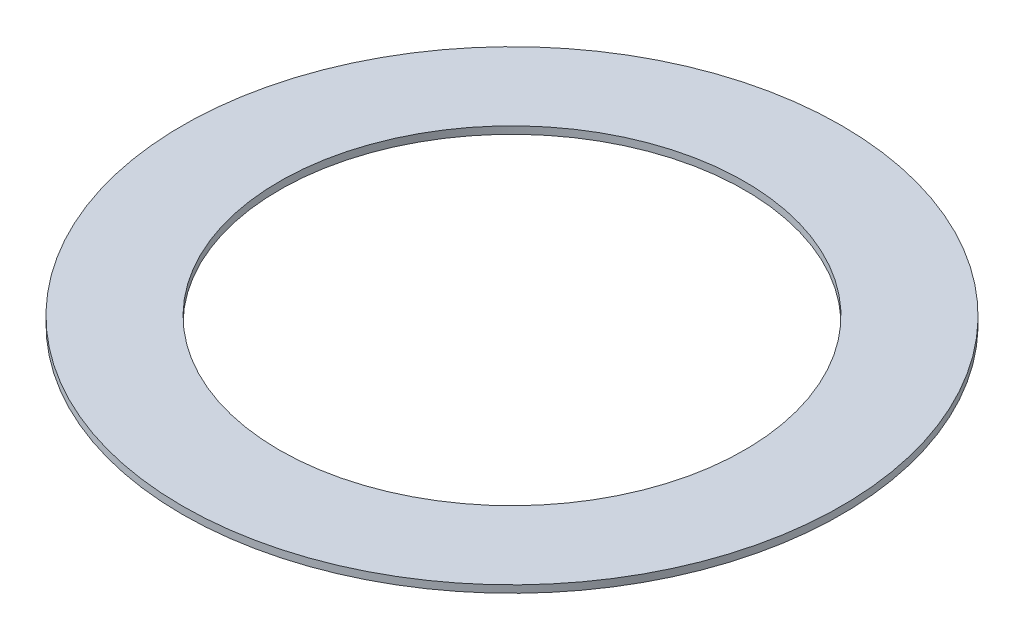
ISO-10303-21;
HEADER;
FILE_DESCRIPTION(('STEP AP214'),'2;1');
FILE_NAME('part.step','',(''),(''),'','','');
FILE_SCHEMA(('AUTOMOTIVE_DESIGN { 1 0 10303 214 1 1 1 1 }'));
ENDSEC;
DATA;
#1=APPLICATION_CONTEXT('core data for automotive mechanical design processes');
#2=APPLICATION_PROTOCOL_DEFINITION('international standard','automotive_design',2000,#1);
#3=PRODUCT_CONTEXT('',#1,'mechanical');
#4=PRODUCT('Part','Part','',(#3));
#5=PRODUCT_RELATED_PRODUCT_CATEGORY('part','',(#4));
#6=PRODUCT_DEFINITION_FORMATION('','',#4);
#7=PRODUCT_DEFINITION_CONTEXT('part definition',#1,'design');
#8=PRODUCT_DEFINITION('design','',#6,#7);
#9=PRODUCT_DEFINITION_SHAPE('','',#8);
#10=(LENGTH_UNIT() NAMED_UNIT(*) SI_UNIT(.MILLI.,.METRE.));
#11=(NAMED_UNIT(*) PLANE_ANGLE_UNIT() SI_UNIT($,.RADIAN.));
#12=(NAMED_UNIT(*) SI_UNIT($,.STERADIAN.) SOLID_ANGLE_UNIT());
#13=UNCERTAINTY_MEASURE_WITH_UNIT(LENGTH_MEASURE(1.E-05),#10,'distance_accuracy_value','');
#14=(GEOMETRIC_REPRESENTATION_CONTEXT(3) GLOBAL_UNCERTAINTY_ASSIGNED_CONTEXT((#13)) GLOBAL_UNIT_ASSIGNED_CONTEXT((#10,
#11,#12)) REPRESENTATION_CONTEXT('',''));
#15=CARTESIAN_POINT('',(0.,0.,0.));
#16=DIRECTION('',(0.,0.,1.));
#17=DIRECTION('',(1.,0.,0.));
#18=AXIS2_PLACEMENT_3D('',#15,#16,#17);
#19=CARTESIAN_POINT('',(0.,2.4,0.));
#20=DIRECTION('',(0.,1.,0.));
#21=DIRECTION('',(0.,0.,1.));
#22=AXIS2_PLACEMENT_3D('',#19,#20,#21);
#23=PLANE('',#22);
#24=CARTESIAN_POINT('',(0.,2.4,0.));
#25=DIRECTION('',(0.,1.,0.));
#26=DIRECTION('',(0.,0.,1.));
#27=AXIS2_PLACEMENT_3D('',#24,#25,#26);
#28=CIRCLE('',#27,107.95);
#29=CARTESIAN_POINT('',(0.,2.4,107.95));
#30=VERTEX_POINT('',#29);
#31=EDGE_CURVE('E10',#30,#30,#28,.T.);
#32=ORIENTED_EDGE('',*,*,#31,.T.);
#33=EDGE_LOOP('',(#32));
#34=FACE_BOUND('',#33,.T.);
#35=CARTESIAN_POINT('',(0.,2.4,0.));
#36=DIRECTION('',(0.,1.,0.));
#37=DIRECTION('',(0.,0.,1.));
#38=AXIS2_PLACEMENT_3D('',#35,#36,#37);
#39=CIRCLE('',#38,76.2);
#40=CARTESIAN_POINT('',(0.,2.4,76.2));
#41=VERTEX_POINT('',#40);
#42=EDGE_CURVE('E43',#41,#41,#39,.T.);
#43=ORIENTED_EDGE('',*,*,#42,.F.);
#44=EDGE_LOOP('',(#43));
#45=FACE_BOUND('',#44,.T.);
#46=ADVANCED_FACE('F32',(#34,#45),#23,.T.);
#47=CARTESIAN_POINT('',(0.,0.,0.));
#48=DIRECTION('',(0.,1.,0.));
#49=DIRECTION('',(0.,0.,1.));
#50=AXIS2_PLACEMENT_3D('',#47,#48,#49);
#51=PLANE('',#50);
#52=CARTESIAN_POINT('',(0.,0.,0.));
#53=DIRECTION('',(0.,1.,0.));
#54=DIRECTION('',(0.,0.,1.));
#55=AXIS2_PLACEMENT_3D('',#52,#53,#54);
#56=CIRCLE('',#55,107.95);
#57=CARTESIAN_POINT('',(0.,0.,107.95));
#58=VERTEX_POINT('',#57);
#59=EDGE_CURVE('E36',#58,#58,#56,.T.);
#60=ORIENTED_EDGE('',*,*,#59,.F.);
#61=EDGE_LOOP('',(#60));
#62=FACE_BOUND('',#61,.T.);
#63=CARTESIAN_POINT('',(0.,0.,0.));
#64=DIRECTION('',(0.,1.,0.));
#65=DIRECTION('',(0.,0.,1.));
#66=AXIS2_PLACEMENT_3D('',#63,#64,#65);
#67=CIRCLE('',#66,76.2);
#68=CARTESIAN_POINT('',(0.,0.,76.2));
#69=VERTEX_POINT('',#68);
#70=EDGE_CURVE('E45',#69,#69,#67,.T.);
#71=ORIENTED_EDGE('',*,*,#70,.T.);
#72=EDGE_LOOP('',(#71));
#73=FACE_BOUND('',#72,.T.);
#74=ADVANCED_FACE('F55',(#62,#73),#51,.F.);
#75=CARTESIAN_POINT('',(0.,2.4,0.));
#76=DIRECTION('',(0.,-1.,0.));
#77=DIRECTION('',(0.,0.,-1.));
#78=AXIS2_PLACEMENT_3D('',#75,#76,#77);
#79=CYLINDRICAL_SURFACE('',#78,107.95);
#80=ORIENTED_EDGE('',*,*,#31,.F.);
#81=EDGE_LOOP('',(#80));
#82=FACE_BOUND('',#81,.T.);
#83=ORIENTED_EDGE('',*,*,#59,.T.);
#84=EDGE_LOOP('',(#83));
#85=FACE_BOUND('',#84,.T.);
#86=ADVANCED_FACE('F34',(#82,#85),#79,.T.);
#87=CARTESIAN_POINT('',(0.,2.4,0.));
#88=DIRECTION('',(0.,-1.,0.));
#89=DIRECTION('',(0.,0.,-1.));
#90=AXIS2_PLACEMENT_3D('',#87,#88,#89);
#91=CYLINDRICAL_SURFACE('',#90,76.2);
#92=ORIENTED_EDGE('',*,*,#42,.T.);
#93=EDGE_LOOP('',(#92));
#94=FACE_BOUND('',#93,.T.);
#95=ORIENTED_EDGE('',*,*,#70,.F.);
#96=EDGE_LOOP('',(#95));
#97=FACE_BOUND('',#96,.T.);
#98=ADVANCED_FACE('F51',(#94,#97),#91,.F.);
#99=CLOSED_SHELL('',(#46,#74,#86,#98));
#100=MANIFOLD_SOLID_BREP('B2',#99);
#101=ADVANCED_BREP_SHAPE_REPRESENTATION('',(#18,#100),#14);
#102=SHAPE_DEFINITION_REPRESENTATION(#9,#101);
ENDSEC;
END-ISO-10303-21;
